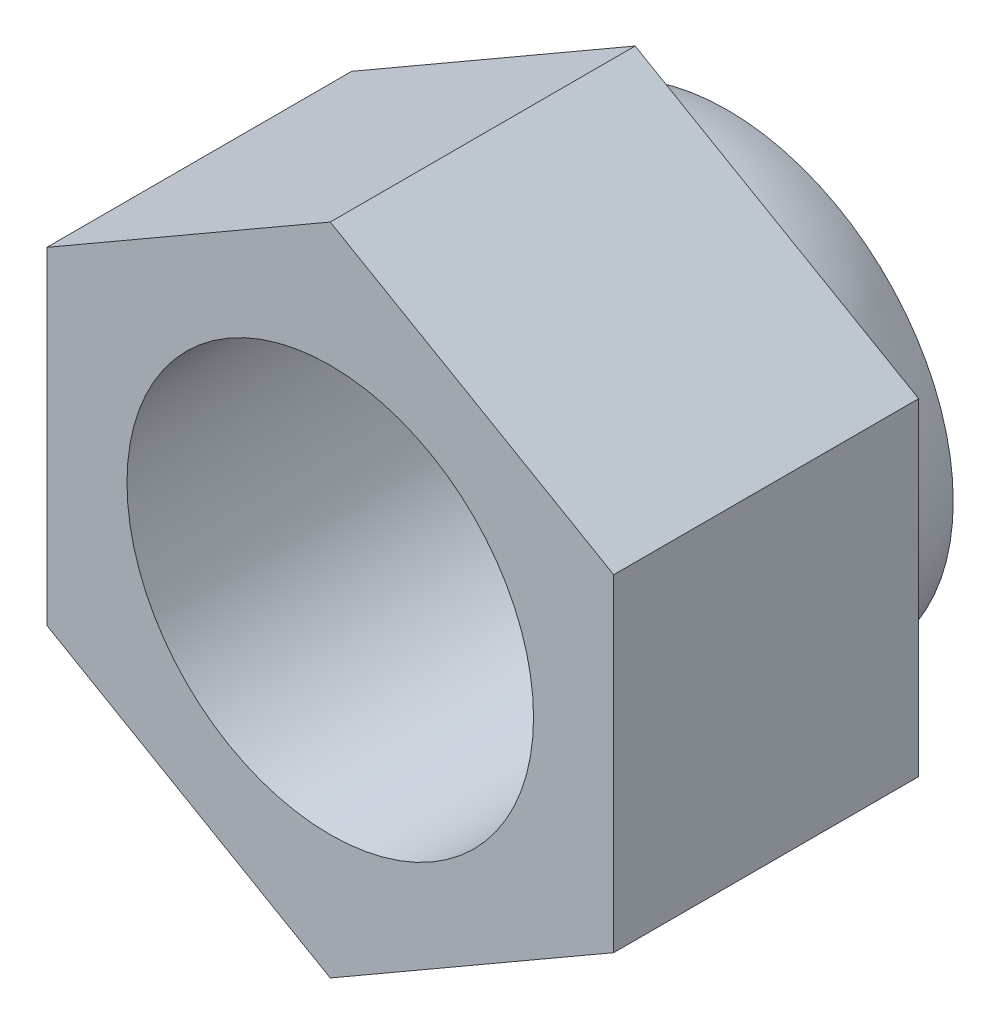
ISO-10303-21;
HEADER;
FILE_DESCRIPTION(('STEP AP214'),'2;1');
FILE_NAME('part.step','',(''),(''),'','','');
FILE_SCHEMA(('AUTOMOTIVE_DESIGN { 1 0 10303 214 1 1 1 1 }'));
ENDSEC;
DATA;
#1=APPLICATION_CONTEXT('core data for automotive mechanical design processes');
#2=APPLICATION_PROTOCOL_DEFINITION('international standard','automotive_design',2000,#1);
#3=PRODUCT_CONTEXT('',#1,'mechanical');
#4=PRODUCT('Part','Part','',(#3));
#5=PRODUCT_RELATED_PRODUCT_CATEGORY('part','',(#4));
#6=PRODUCT_DEFINITION_FORMATION('','',#4);
#7=PRODUCT_DEFINITION_CONTEXT('part definition',#1,'design');
#8=PRODUCT_DEFINITION('design','',#6,#7);
#9=PRODUCT_DEFINITION_SHAPE('','',#8);
#10=(LENGTH_UNIT() NAMED_UNIT(*) SI_UNIT(.MILLI.,.METRE.));
#11=(NAMED_UNIT(*) PLANE_ANGLE_UNIT() SI_UNIT($,.RADIAN.));
#12=(NAMED_UNIT(*) SI_UNIT($,.STERADIAN.) SOLID_ANGLE_UNIT());
#13=UNCERTAINTY_MEASURE_WITH_UNIT(LENGTH_MEASURE(1.E-05),#10,'distance_accuracy_value','');
#14=(GEOMETRIC_REPRESENTATION_CONTEXT(3) GLOBAL_UNCERTAINTY_ASSIGNED_CONTEXT((#13)) GLOBAL_UNIT_ASSIGNED_CONTEXT((#10,
#11,#12)) REPRESENTATION_CONTEXT('',''));
#15=CARTESIAN_POINT('',(0.,0.,0.));
#16=DIRECTION('',(0.,0.,1.));
#17=DIRECTION('',(1.,0.,0.));
#18=AXIS2_PLACEMENT_3D('',#15,#16,#17);
#19=CARTESIAN_POINT('',(0.,0.,1.5));
#20=DIRECTION('',(0.,0.,1.));
#21=DIRECTION('',(1.,0.,0.));
#22=AXIS2_PLACEMENT_3D('',#19,#20,#21);
#23=PLANE('',#22);
#24=DIRECTION('',(-0.866025403784442,0.499999999999995,0.));
#25=VECTOR('',#24,1.);
#26=CARTESIAN_POINT('',(1.39458403937313,0.805163470539654,1.5));
#27=LINE('',#26,#25);
#28=CARTESIAN_POINT('',(1.39458403937313,0.805163470539654,1.5));
#29=VERTEX_POINT('',#28);
#30=CARTESIAN_POINT('',(0.,1.61032694107928,1.5));
#31=VERTEX_POINT('',#30);
#32=EDGE_CURVE('E149',#29,#31,#27,.T.);
#33=ORIENTED_EDGE('',*,*,#32,.T.);
#34=DIRECTION('',(-0.866025403784438,-0.500000000000001,0.));
#35=VECTOR('',#34,1.);
#36=CARTESIAN_POINT('',(0.,1.61032694107928,1.5));
#37=LINE('',#36,#35);
#38=CARTESIAN_POINT('',(-1.39458403937314,0.805163470539635,1.5));
#39=VERTEX_POINT('',#38);
#40=EDGE_CURVE('E97',#31,#39,#37,.T.);
#41=ORIENTED_EDGE('',*,*,#40,.T.);
#42=DIRECTION('',(0.,-1.,0.));
#43=VECTOR('',#42,1.);
#44=CARTESIAN_POINT('',(-1.39458403937314,0.805163470539635,1.5));
#45=LINE('',#44,#43);
#46=CARTESIAN_POINT('',(-1.39458403937314,-0.805163470539644,1.5));
#47=VERTEX_POINT('',#46);
#48=EDGE_CURVE('E110',#39,#47,#45,.T.);
#49=ORIENTED_EDGE('',*,*,#48,.T.);
#50=DIRECTION('',(0.866025403784442,-0.499999999999995,0.));
#51=VECTOR('',#50,1.);
#52=CARTESIAN_POINT('',(-1.39458403937314,-0.805163470539644,1.5));
#53=LINE('',#52,#51);
#54=CARTESIAN_POINT('',(0.,-1.61032694107928,1.5));
#55=VERTEX_POINT('',#54);
#56=EDGE_CURVE('E104',#47,#55,#53,.T.);
#57=ORIENTED_EDGE('',*,*,#56,.T.);
#58=DIRECTION('',(0.866025403784435,0.500000000000007,0.));
#59=VECTOR('',#58,1.);
#60=CARTESIAN_POINT('',(0.,-1.61032694107928,1.5));
#61=LINE('',#60,#59);
#62=CARTESIAN_POINT('',(1.39458403937315,-0.805163470539625,1.5));
#63=VERTEX_POINT('',#62);
#64=EDGE_CURVE('E108',#55,#63,#61,.T.);
#65=ORIENTED_EDGE('',*,*,#64,.T.);
#66=DIRECTION('',(0.,1.,0.));
#67=VECTOR('',#66,1.);
#68=CARTESIAN_POINT('',(1.39458403937315,-0.805163470539625,1.5));
#69=LINE('',#68,#67);
#70=EDGE_CURVE('E59',#63,#29,#69,.T.);
#71=ORIENTED_EDGE('',*,*,#70,.T.);
#72=EDGE_LOOP('',(#33,#41,#49,#57,#65,#71));
#73=FACE_BOUND('',#72,.T.);
#74=CARTESIAN_POINT('',(0.,0.,1.5));
#75=DIRECTION('',(0.,0.,1.));
#76=DIRECTION('',(1.,0.,0.));
#77=AXIS2_PLACEMENT_3D('',#74,#75,#76);
#78=CIRCLE('',#77,1.);
#79=CARTESIAN_POINT('',(1.,0.,1.5));
#80=VERTEX_POINT('',#79);
#81=EDGE_CURVE('E137',#80,#80,#78,.T.);
#82=ORIENTED_EDGE('',*,*,#81,.F.);
#83=EDGE_LOOP('',(#82));
#84=FACE_BOUND('',#83,.T.);
#85=ADVANCED_FACE('F41',(#73,#84),#23,.T.);
#86=CARTESIAN_POINT('',(0.,0.,0.));
#87=DIRECTION('',(0.,0.,1.));
#88=DIRECTION('',(1.,0.,0.));
#89=AXIS2_PLACEMENT_3D('',#86,#87,#88);
#90=PLANE('',#89);
#91=CARTESIAN_POINT('',(0.,0.,0.));
#92=DIRECTION('',(0.,0.,1.));
#93=DIRECTION('',(1.,0.,0.));
#94=AXIS2_PLACEMENT_3D('',#91,#92,#93);
#95=CIRCLE('',#94,1.29614813968157);
#96=CARTESIAN_POINT('',(1.29614813968158,0.,0.));
#97=VERTEX_POINT('',#96);
#98=EDGE_CURVE('E11',#97,#97,#95,.T.);
#99=ORIENTED_EDGE('',*,*,#98,.T.);
#100=EDGE_LOOP('',(#99));
#101=FACE_BOUND('',#100,.T.);
#102=DIRECTION('',(-0.866025403784442,0.499999999999995,0.));
#103=VECTOR('',#102,1.);
#104=CARTESIAN_POINT('',(1.39458403937313,0.805163470539654,0.));
#105=LINE('',#104,#103);
#106=CARTESIAN_POINT('',(1.39458403937313,0.805163470539654,0.));
#107=VERTEX_POINT('',#106);
#108=CARTESIAN_POINT('',(0.,1.61032694107928,0.));
#109=VERTEX_POINT('',#108);
#110=EDGE_CURVE('E132',#107,#109,#105,.T.);
#111=ORIENTED_EDGE('',*,*,#110,.F.);
#112=DIRECTION('',(0.,1.,0.));
#113=VECTOR('',#112,1.);
#114=CARTESIAN_POINT('',(1.39458403937315,-0.805163470539625,0.));
#115=LINE('',#114,#113);
#116=CARTESIAN_POINT('',(1.39458403937315,-0.805163470539625,0.));
#117=VERTEX_POINT('',#116);
#118=EDGE_CURVE('E88',#117,#107,#115,.T.);
#119=ORIENTED_EDGE('',*,*,#118,.F.);
#120=DIRECTION('',(0.866025403784435,0.500000000000007,0.));
#121=VECTOR('',#120,1.);
#122=CARTESIAN_POINT('',(0.,-1.61032694107928,0.));
#123=LINE('',#122,#121);
#124=CARTESIAN_POINT('',(0.,-1.61032694107928,0.));
#125=VERTEX_POINT('',#124);
#126=EDGE_CURVE('E82',#125,#117,#123,.T.);
#127=ORIENTED_EDGE('',*,*,#126,.F.);
#128=DIRECTION('',(0.866025403784442,-0.499999999999995,0.));
#129=VECTOR('',#128,1.);
#130=CARTESIAN_POINT('',(-1.39458403937314,-0.805163470539644,0.));
#131=LINE('',#130,#129);
#132=CARTESIAN_POINT('',(-1.39458403937314,-0.805163470539644,0.));
#133=VERTEX_POINT('',#132);
#134=EDGE_CURVE('E119',#133,#125,#131,.T.);
#135=ORIENTED_EDGE('',*,*,#134,.F.);
#136=DIRECTION('',(0.,-1.,0.));
#137=VECTOR('',#136,1.);
#138=CARTESIAN_POINT('',(-1.39458403937314,0.805163470539635,0.));
#139=LINE('',#138,#137);
#140=CARTESIAN_POINT('',(-1.39458403937314,0.805163470539635,0.));
#141=VERTEX_POINT('',#140);
#142=EDGE_CURVE('E140',#141,#133,#139,.T.);
#143=ORIENTED_EDGE('',*,*,#142,.F.);
#144=DIRECTION('',(-0.866025403784438,-0.500000000000001,0.));
#145=VECTOR('',#144,1.);
#146=CARTESIAN_POINT('',(0.,1.61032694107928,0.));
#147=LINE('',#146,#145);
#148=EDGE_CURVE('E136',#109,#141,#147,.T.);
#149=ORIENTED_EDGE('',*,*,#148,.F.);
#150=EDGE_LOOP('',(#111,#119,#127,#135,#143,#149));
#151=FACE_BOUND('',#150,.T.);
#152=ADVANCED_FACE('F184',(#101,#151),#90,.F.);
#153=CARTESIAN_POINT('',(1.39458403937313,0.805163470539654,1.5));
#154=DIRECTION('',(-0.499999999999995,-0.866025403784441,0.));
#155=DIRECTION('',(0.866025403784442,-0.499999999999995,0.));
#156=AXIS2_PLACEMENT_3D('',#153,#154,#155);
#157=PLANE('',#156);
#158=ORIENTED_EDGE('',*,*,#110,.T.);
#159=DIRECTION('',(0.,0.,-1.));
#160=VECTOR('',#159,1.);
#161=CARTESIAN_POINT('',(0.,1.61032694107928,1.5));
#162=LINE('',#161,#160);
#163=EDGE_CURVE('E160',#31,#109,#162,.T.);
#164=ORIENTED_EDGE('',*,*,#163,.F.);
#165=ORIENTED_EDGE('',*,*,#32,.F.);
#166=DIRECTION('',(0.,0.,-1.));
#167=VECTOR('',#166,1.);
#168=CARTESIAN_POINT('',(1.39458403937313,0.805163470539654,1.5));
#169=LINE('',#168,#167);
#170=EDGE_CURVE('E128',#29,#107,#169,.T.);
#171=ORIENTED_EDGE('',*,*,#170,.T.);
#172=EDGE_LOOP('',(#158,#164,#165,#171));
#173=FACE_BOUND('',#172,.T.);
#174=ADVANCED_FACE('F189',(#173),#157,.F.);
#175=CARTESIAN_POINT('',(0.,1.61032694107928,1.5));
#176=DIRECTION('',(0.500000000000001,-0.866025403784438,0.));
#177=DIRECTION('',(0.866025403784438,0.500000000000001,0.));
#178=AXIS2_PLACEMENT_3D('',#175,#176,#177);
#179=PLANE('',#178);
#180=ORIENTED_EDGE('',*,*,#148,.T.);
#181=DIRECTION('',(0.,0.,-1.));
#182=VECTOR('',#181,1.);
#183=CARTESIAN_POINT('',(-1.39458403937314,0.805163470539635,1.5));
#184=LINE('',#183,#182);
#185=EDGE_CURVE('E156',#39,#141,#184,.T.);
#186=ORIENTED_EDGE('',*,*,#185,.F.);
#187=ORIENTED_EDGE('',*,*,#40,.F.);
#188=ORIENTED_EDGE('',*,*,#163,.T.);
#189=EDGE_LOOP('',(#180,#186,#187,#188));
#190=FACE_BOUND('',#189,.T.);
#191=ADVANCED_FACE('F206',(#190),#179,.F.);
#192=CARTESIAN_POINT('',(-1.39458403937314,0.805163470539635,1.5));
#193=DIRECTION('',(1.,0.,0.));
#194=DIRECTION('',(0.,1.,0.));
#195=AXIS2_PLACEMENT_3D('',#192,#193,#194);
#196=PLANE('',#195);
#197=ORIENTED_EDGE('',*,*,#142,.T.);
#198=DIRECTION('',(0.,0.,-1.));
#199=VECTOR('',#198,1.);
#200=CARTESIAN_POINT('',(-1.39458403937314,-0.805163470539644,1.5));
#201=LINE('',#200,#199);
#202=EDGE_CURVE('E121',#47,#133,#201,.T.);
#203=ORIENTED_EDGE('',*,*,#202,.F.);
#204=ORIENTED_EDGE('',*,*,#48,.F.);
#205=ORIENTED_EDGE('',*,*,#185,.T.);
#206=EDGE_LOOP('',(#197,#203,#204,#205));
#207=FACE_BOUND('',#206,.T.);
#208=ADVANCED_FACE('F203',(#207),#196,.F.);
#209=CARTESIAN_POINT('',(-1.39458403937314,-0.805163470539644,1.5));
#210=DIRECTION('',(0.499999999999995,0.866025403784441,0.));
#211=DIRECTION('',(-0.866025403784442,0.499999999999995,0.));
#212=AXIS2_PLACEMENT_3D('',#209,#210,#211);
#213=PLANE('',#212);
#214=ORIENTED_EDGE('',*,*,#134,.T.);
#215=DIRECTION('',(0.,0.,-1.));
#216=VECTOR('',#215,1.);
#217=CARTESIAN_POINT('',(0.,-1.61032694107928,1.5));
#218=LINE('',#217,#216);
#219=EDGE_CURVE('E116',#55,#125,#218,.T.);
#220=ORIENTED_EDGE('',*,*,#219,.F.);
#221=ORIENTED_EDGE('',*,*,#56,.F.);
#222=ORIENTED_EDGE('',*,*,#202,.T.);
#223=EDGE_LOOP('',(#214,#220,#221,#222));
#224=FACE_BOUND('',#223,.T.);
#225=ADVANCED_FACE('F117',(#224),#213,.F.);
#226=CARTESIAN_POINT('',(0.,-1.61032694107928,1.5));
#227=DIRECTION('',(-0.500000000000007,0.866025403784434,0.));
#228=DIRECTION('',(-0.866025403784435,-0.500000000000007,0.));
#229=AXIS2_PLACEMENT_3D('',#226,#227,#228);
#230=PLANE('',#229);
#231=ORIENTED_EDGE('',*,*,#126,.T.);
#232=DIRECTION('',(0.,0.,-1.));
#233=VECTOR('',#232,1.);
#234=CARTESIAN_POINT('',(1.39458403937315,-0.805163470539625,1.5));
#235=LINE('',#234,#233);
#236=EDGE_CURVE('E122',#63,#117,#235,.T.);
#237=ORIENTED_EDGE('',*,*,#236,.F.);
#238=ORIENTED_EDGE('',*,*,#64,.F.);
#239=ORIENTED_EDGE('',*,*,#219,.T.);
#240=EDGE_LOOP('',(#231,#237,#238,#239));
#241=FACE_BOUND('',#240,.T.);
#242=ADVANCED_FACE('F124',(#241),#230,.F.);
#243=CARTESIAN_POINT('',(1.39458403937315,-0.805163470539625,1.5));
#244=DIRECTION('',(-1.,0.,0.));
#245=DIRECTION('',(0.,-1.,0.));
#246=AXIS2_PLACEMENT_3D('',#243,#244,#245);
#247=PLANE('',#246);
#248=ORIENTED_EDGE('',*,*,#118,.T.);
#249=ORIENTED_EDGE('',*,*,#170,.F.);
#250=ORIENTED_EDGE('',*,*,#70,.F.);
#251=ORIENTED_EDGE('',*,*,#236,.T.);
#252=EDGE_LOOP('',(#248,#249,#250,#251));
#253=FACE_BOUND('',#252,.T.);
#254=ADVANCED_FACE('F196',(#253),#247,.F.);
#255=CARTESIAN_POINT('',(0.,0.,1.5));
#256=DIRECTION('',(0.,0.,-1.));
#257=DIRECTION('',(-1.,0.,0.));
#258=AXIS2_PLACEMENT_3D('',#255,#256,#257);
#259=CYLINDRICAL_SURFACE('',#258,1.);
#260=CARTESIAN_POINT('',(0.,0.,-0.453881568537332));
#261=DIRECTION('',(0.,0.,1.));
#262=DIRECTION('',(1.,0.,0.));
#263=AXIS2_PLACEMENT_3D('',#260,#261,#262);
#264=CIRCLE('',#263,1.);
#265=CARTESIAN_POINT('',(1.,0.,-0.453881568537332));
#266=VERTEX_POINT('',#265);
#267=EDGE_CURVE('E166',#266,#266,#264,.T.);
#268=ORIENTED_EDGE('',*,*,#267,.F.);
#269=EDGE_LOOP('',(#268));
#270=FACE_BOUND('',#269,.T.);
#271=ORIENTED_EDGE('',*,*,#81,.T.);
#272=EDGE_LOOP('',(#271));
#273=FACE_BOUND('',#272,.T.);
#274=ADVANCED_FACE('F193',(#270,#273),#259,.F.);
#275=CARTESIAN_POINT('',(0.,0.,0.));
#276=DIRECTION('',(0.,0.,1.));
#277=DIRECTION('',(-1.,0.,0.));
#278=AXIS2_PLACEMENT_3D('',#275,#276,#277);
#279=SPHERICAL_SURFACE('',#278,1.2);
#280=CARTESIAN_POINT('',(0.,0.,-0.0923076923076921));
#281=DIRECTION('',(0.,0.,1.));
#282=DIRECTION('',(1.,0.,0.));
#283=AXIS2_PLACEMENT_3D('',#280,#281,#282);
#284=CIRCLE('',#283,1.19644443662915);
#285=CARTESIAN_POINT('',(1.19644443662915,0.,-0.0923076923076921));
#286=VERTEX_POINT('',#285);
#287=EDGE_CURVE('E51',#286,#286,#284,.F.);
#288=ORIENTED_EDGE('',*,*,#287,.T.);
#289=EDGE_LOOP('',(#288));
#290=FACE_BOUND('',#289,.T.);
#291=CARTESIAN_POINT('',(0.,0.,-0.453881568537331));
#292=DIRECTION('',(0.,0.,1.));
#293=DIRECTION('',(1.,0.,0.));
#294=AXIS2_PLACEMENT_3D('',#291,#292,#293);
#295=CIRCLE('',#294,1.11085171005949);
#296=CARTESIAN_POINT('',(1.11085171005949,0.,-0.453881568537331));
#297=VERTEX_POINT('',#296);
#298=EDGE_CURVE('E163',#297,#297,#295,.T.);
#299=ORIENTED_EDGE('',*,*,#298,.T.);
#300=EDGE_LOOP('',(#299));
#301=FACE_BOUND('',#300,.T.);
#302=ADVANCED_FACE('F171',(#290,#301),#279,.T.);
#303=CARTESIAN_POINT('',(-0.636610303258269,-2.78303754157397,-0.453881568537331));
#304=DIRECTION('',(0.,0.,1.));
#305=DIRECTION('',(1.,0.,0.));
#306=AXIS2_PLACEMENT_3D('',#303,#304,#305);
#307=PLANE('',#306);
#308=ORIENTED_EDGE('',*,*,#267,.T.);
#309=EDGE_LOOP('',(#308));
#310=FACE_BOUND('',#309,.T.);
#311=ORIENTED_EDGE('',*,*,#298,.F.);
#312=EDGE_LOOP('',(#311));
#313=FACE_BOUND('',#312,.T.);
#314=ADVANCED_FACE('F175',(#310,#313),#307,.F.);
#315=CARTESIAN_POINT('',(0.,0.,-0.1));
#316=DIRECTION('',(0.,0.,1.));
#317=DIRECTION('',(1.,0.,0.));
#318=AXIS2_PLACEMENT_3D('',#315,#316,#317);
#319=TOROIDAL_SURFACE('',#318,1.29614813968157,0.1);
#320=ORIENTED_EDGE('',*,*,#98,.F.);
#321=EDGE_LOOP('',(#320));
#322=FACE_BOUND('',#321,.T.);
#323=ORIENTED_EDGE('',*,*,#287,.F.);
#324=EDGE_LOOP('',(#323));
#325=FACE_BOUND('',#324,.T.);
#326=ADVANCED_FACE('F43',(#322,#325),#319,.F.);
#327=CLOSED_SHELL('',(#85,#152,#174,#191,#208,#225,#242,#254,#274,#302,#314,#326));
#328=MANIFOLD_SOLID_BREP('B2',#327);
#329=ADVANCED_BREP_SHAPE_REPRESENTATION('',(#18,#328),#14);
#330=SHAPE_DEFINITION_REPRESENTATION(#9,#329);
ENDSEC;
END-ISO-10303-21;
